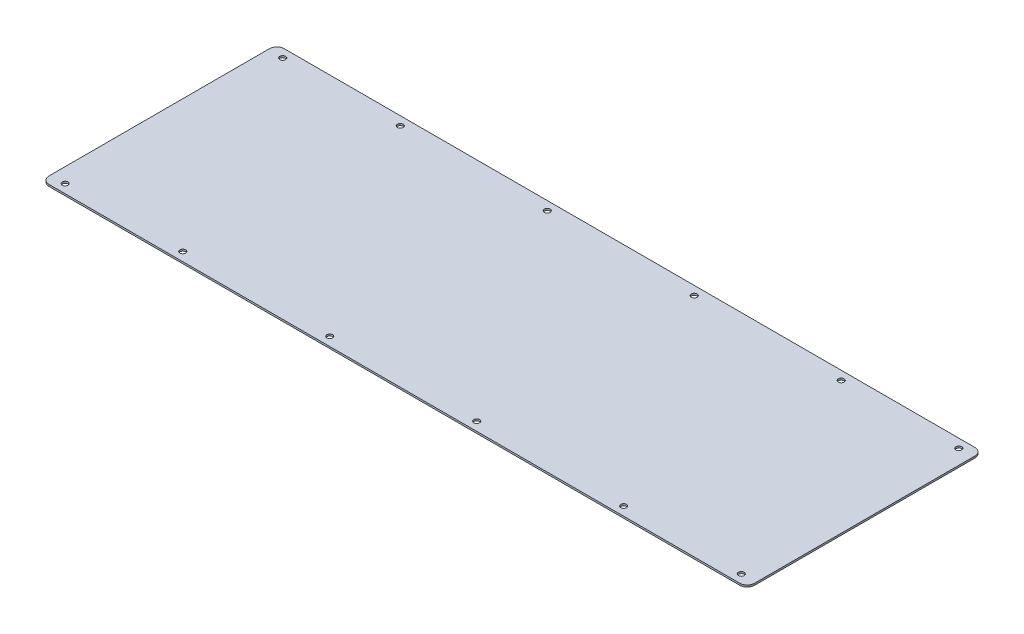
ISO-10303-21;
HEADER;
FILE_DESCRIPTION(('STEP AP214'),'2;1');
FILE_NAME('part.step','',(''),(''),'','','');
FILE_SCHEMA(('AUTOMOTIVE_DESIGN { 1 0 10303 214 1 1 1 1 }'));
ENDSEC;
DATA;
#1=APPLICATION_CONTEXT('core data for automotive mechanical design processes');
#2=APPLICATION_PROTOCOL_DEFINITION('international standard','automotive_design',2000,#1);
#3=PRODUCT_CONTEXT('',#1,'mechanical');
#4=PRODUCT('Part','Part','',(#3));
#5=PRODUCT_RELATED_PRODUCT_CATEGORY('part','',(#4));
#6=PRODUCT_DEFINITION_FORMATION('','',#4);
#7=PRODUCT_DEFINITION_CONTEXT('part definition',#1,'design');
#8=PRODUCT_DEFINITION('design','',#6,#7);
#9=PRODUCT_DEFINITION_SHAPE('','',#8);
#10=(LENGTH_UNIT() NAMED_UNIT(*) SI_UNIT(.MILLI.,.METRE.));
#11=(NAMED_UNIT(*) PLANE_ANGLE_UNIT() SI_UNIT($,.RADIAN.));
#12=(NAMED_UNIT(*) SI_UNIT($,.STERADIAN.) SOLID_ANGLE_UNIT());
#13=UNCERTAINTY_MEASURE_WITH_UNIT(LENGTH_MEASURE(1.E-05),#10,'distance_accuracy_value','');
#14=(GEOMETRIC_REPRESENTATION_CONTEXT(3) GLOBAL_UNCERTAINTY_ASSIGNED_CONTEXT((#13)) GLOBAL_UNIT_ASSIGNED_CONTEXT((#10,
#11,#12)) REPRESENTATION_CONTEXT('',''));
#15=CARTESIAN_POINT('',(0.,0.,0.));
#16=DIRECTION('',(0.,0.,1.));
#17=DIRECTION('',(1.,0.,0.));
#18=AXIS2_PLACEMENT_3D('',#15,#16,#17);
#19=CARTESIAN_POINT('',(0.,1.5875,0.));
#20=DIRECTION('',(1.,0.,0.));
#21=DIRECTION('',(0.,0.,-1.));
#22=AXIS2_PLACEMENT_3D('',#19,#20,#21);
#23=PLANE('',#22);
#24=DIRECTION('',(0.,0.,1.));
#25=VECTOR('',#24,1.);
#26=CARTESIAN_POINT('',(0.,1.5875,0.));
#27=LINE('',#26,#25);
#28=CARTESIAN_POINT('',(0.,1.5875,-196.85));
#29=VERTEX_POINT('',#28);
#30=CARTESIAN_POINT('',(0.,1.5875,-6.35));
#31=VERTEX_POINT('',#30);
#32=EDGE_CURVE('E118',#29,#31,#27,.T.);
#33=ORIENTED_EDGE('',*,*,#32,.F.);
#34=DIRECTION('',(0.,-1.,0.));
#35=VECTOR('',#34,1.);
#36=CARTESIAN_POINT('',(0.,1.5875,-196.85));
#37=LINE('',#36,#35);
#38=CARTESIAN_POINT('',(0.,0.,-196.85));
#39=VERTEX_POINT('',#38);
#40=EDGE_CURVE('E103',#29,#39,#37,.T.);
#41=ORIENTED_EDGE('',*,*,#40,.T.);
#42=DIRECTION('',(0.,0.,1.));
#43=VECTOR('',#42,1.);
#44=CARTESIAN_POINT('',(0.,0.,0.));
#45=LINE('',#44,#43);
#46=CARTESIAN_POINT('',(0.,0.,-6.35));
#47=VERTEX_POINT('',#46);
#48=EDGE_CURVE('E115',#39,#47,#45,.T.);
#49=ORIENTED_EDGE('',*,*,#48,.T.);
#50=DIRECTION('',(0.,-1.,0.));
#51=VECTOR('',#50,1.);
#52=CARTESIAN_POINT('',(0.,1.5875,-6.35));
#53=LINE('',#52,#51);
#54=EDGE_CURVE('E120',#47,#31,#53,.F.);
#55=ORIENTED_EDGE('',*,*,#54,.T.);
#56=EDGE_LOOP('',(#33,#41,#49,#55));
#57=FACE_BOUND('',#56,.T.);
#58=ADVANCED_FACE('F33',(#57),#23,.F.);
#59=CARTESIAN_POINT('',(0.,1.5875,0.));
#60=DIRECTION('',(0.,0.,-1.));
#61=DIRECTION('',(-1.,0.,0.));
#62=AXIS2_PLACEMENT_3D('',#59,#60,#61);
#63=PLANE('',#62);
#64=DIRECTION('',(1.,0.,0.));
#65=VECTOR('',#64,1.);
#66=CARTESIAN_POINT('',(0.,0.,0.));
#67=LINE('',#66,#65);
#68=CARTESIAN_POINT('',(6.35,0.,0.));
#69=VERTEX_POINT('',#68);
#70=CARTESIAN_POINT('',(603.25,0.,0.));
#71=VERTEX_POINT('',#70);
#72=EDGE_CURVE('E124',#69,#71,#67,.T.);
#73=ORIENTED_EDGE('',*,*,#72,.T.);
#74=DIRECTION('',(0.,-1.,0.));
#75=VECTOR('',#74,1.);
#76=CARTESIAN_POINT('',(603.25,1.5875,0.));
#77=LINE('',#76,#75);
#78=CARTESIAN_POINT('',(603.25,1.5875,0.));
#79=VERTEX_POINT('',#78);
#80=EDGE_CURVE('E11',#71,#79,#77,.F.);
#81=ORIENTED_EDGE('',*,*,#80,.T.);
#82=DIRECTION('',(1.,0.,0.));
#83=VECTOR('',#82,1.);
#84=CARTESIAN_POINT('',(0.,1.5875,0.));
#85=LINE('',#84,#83);
#86=CARTESIAN_POINT('',(6.35,1.5875,0.));
#87=VERTEX_POINT('',#86);
#88=EDGE_CURVE('E164',#87,#79,#85,.T.);
#89=ORIENTED_EDGE('',*,*,#88,.F.);
#90=DIRECTION('',(0.,-1.,0.));
#91=VECTOR('',#90,1.);
#92=CARTESIAN_POINT('',(6.35,1.5875,0.));
#93=LINE('',#92,#91);
#94=EDGE_CURVE('E41',#87,#69,#93,.T.);
#95=ORIENTED_EDGE('',*,*,#94,.T.);
#96=EDGE_LOOP('',(#73,#81,#89,#95));
#97=FACE_BOUND('',#96,.T.);
#98=ADVANCED_FACE('F162',(#97),#63,.F.);
#99=CARTESIAN_POINT('',(609.6,1.5875,0.));
#100=DIRECTION('',(-1.,0.,0.));
#101=DIRECTION('',(0.,0.,1.));
#102=AXIS2_PLACEMENT_3D('',#99,#100,#101);
#103=PLANE('',#102);
#104=DIRECTION('',(0.,0.,-1.));
#105=VECTOR('',#104,1.);
#106=CARTESIAN_POINT('',(609.6,0.,0.));
#107=LINE('',#106,#105);
#108=CARTESIAN_POINT('',(609.6,0.,-6.35));
#109=VERTEX_POINT('',#108);
#110=CARTESIAN_POINT('',(609.6,0.,-196.85));
#111=VERTEX_POINT('',#110);
#112=EDGE_CURVE('E128',#109,#111,#107,.T.);
#113=ORIENTED_EDGE('',*,*,#112,.T.);
#114=DIRECTION('',(0.,-1.,0.));
#115=VECTOR('',#114,1.);
#116=CARTESIAN_POINT('',(609.6,1.5875,-196.85));
#117=LINE('',#116,#115);
#118=CARTESIAN_POINT('',(609.6,1.5875,-196.85));
#119=VERTEX_POINT('',#118);
#120=EDGE_CURVE('E48',#111,#119,#117,.F.);
#121=ORIENTED_EDGE('',*,*,#120,.T.);
#122=DIRECTION('',(0.,0.,-1.));
#123=VECTOR('',#122,1.);
#124=CARTESIAN_POINT('',(609.6,1.5875,0.));
#125=LINE('',#124,#123);
#126=CARTESIAN_POINT('',(609.6,1.5875,-6.35));
#127=VERTEX_POINT('',#126);
#128=EDGE_CURVE('E172',#127,#119,#125,.T.);
#129=ORIENTED_EDGE('',*,*,#128,.F.);
#130=DIRECTION('',(0.,-1.,0.));
#131=VECTOR('',#130,1.);
#132=CARTESIAN_POINT('',(609.6,1.5875,-6.35));
#133=LINE('',#132,#131);
#134=EDGE_CURVE('E155',#127,#109,#133,.T.);
#135=ORIENTED_EDGE('',*,*,#134,.T.);
#136=EDGE_LOOP('',(#113,#121,#129,#135));
#137=FACE_BOUND('',#136,.T.);
#138=ADVANCED_FACE('F171',(#137),#103,.F.);
#139=CARTESIAN_POINT('',(0.,1.5875,-203.2));
#140=DIRECTION('',(0.,0.,1.));
#141=DIRECTION('',(1.,0.,0.));
#142=AXIS2_PLACEMENT_3D('',#139,#140,#141);
#143=PLANE('',#142);
#144=DIRECTION('',(-1.,0.,0.));
#145=VECTOR('',#144,1.);
#146=CARTESIAN_POINT('',(0.,0.,-203.2));
#147=LINE('',#146,#145);
#148=CARTESIAN_POINT('',(603.25,0.,-203.2));
#149=VERTEX_POINT('',#148);
#150=CARTESIAN_POINT('',(6.35,0.,-203.2));
#151=VERTEX_POINT('',#150);
#152=EDGE_CURVE('E138',#149,#151,#147,.T.);
#153=ORIENTED_EDGE('',*,*,#152,.T.);
#154=DIRECTION('',(0.,-1.,0.));
#155=VECTOR('',#154,1.);
#156=CARTESIAN_POINT('',(6.35,1.5875,-203.2));
#157=LINE('',#156,#155);
#158=CARTESIAN_POINT('',(6.35,1.5875,-203.2));
#159=VERTEX_POINT('',#158);
#160=EDGE_CURVE('E104',#151,#159,#157,.F.);
#161=ORIENTED_EDGE('',*,*,#160,.T.);
#162=DIRECTION('',(-1.,0.,0.));
#163=VECTOR('',#162,1.);
#164=CARTESIAN_POINT('',(0.,1.5875,-203.2));
#165=LINE('',#164,#163);
#166=CARTESIAN_POINT('',(603.25,1.5875,-203.2));
#167=VERTEX_POINT('',#166);
#168=EDGE_CURVE('E134',#167,#159,#165,.T.);
#169=ORIENTED_EDGE('',*,*,#168,.F.);
#170=DIRECTION('',(0.,-1.,0.));
#171=VECTOR('',#170,1.);
#172=CARTESIAN_POINT('',(603.25,1.5875,-203.2));
#173=LINE('',#172,#171);
#174=EDGE_CURVE('E109',#167,#149,#173,.T.);
#175=ORIENTED_EDGE('',*,*,#174,.T.);
#176=EDGE_LOOP('',(#153,#161,#169,#175));
#177=FACE_BOUND('',#176,.T.);
#178=ADVANCED_FACE('F260',(#177),#143,.F.);
#179=CARTESIAN_POINT('',(0.,1.5875,0.));
#180=DIRECTION('',(0.,-1.,0.));
#181=DIRECTION('',(0.,0.,-1.));
#182=AXIS2_PLACEMENT_3D('',#179,#180,#181);
#183=PLANE('',#182);
#184=CARTESIAN_POINT('',(368.3,1.5875,-7.62));
#185=DIRECTION('',(0.,1.,0.));
#186=DIRECTION('',(0.,0.,1.));
#187=AXIS2_PLACEMENT_3D('',#184,#185,#186);
#188=CIRCLE('',#187,2.48920000000001);
#189=CARTESIAN_POINT('',(368.3,1.5875,-5.13079999999999));
#190=VERTEX_POINT('',#189);
#191=EDGE_CURVE('E212',#190,#190,#188,.T.);
#192=ORIENTED_EDGE('',*,*,#191,.F.);
#193=EDGE_LOOP('',(#192));
#194=FACE_BOUND('',#193,.T.);
#195=CARTESIAN_POINT('',(368.3,1.5875,-195.58));
#196=DIRECTION('',(0.,1.,0.));
#197=DIRECTION('',(0.,0.,-1.));
#198=AXIS2_PLACEMENT_3D('',#195,#196,#197);
#199=CIRCLE('',#198,2.48920000000001);
#200=CARTESIAN_POINT('',(368.3,1.5875,-198.0692));
#201=VERTEX_POINT('',#200);
#202=EDGE_CURVE('E205',#201,#201,#199,.T.);
#203=ORIENTED_EDGE('',*,*,#202,.F.);
#204=EDGE_LOOP('',(#203));
#205=FACE_BOUND('',#204,.T.);
#206=CARTESIAN_POINT('',(241.3,1.5875,-195.58));
#207=DIRECTION('',(0.,1.,0.));
#208=DIRECTION('',(0.,0.,-1.));
#209=AXIS2_PLACEMENT_3D('',#206,#207,#208);
#210=CIRCLE('',#209,2.4892);
#211=CARTESIAN_POINT('',(241.3,1.5875,-198.0692));
#212=VERTEX_POINT('',#211);
#213=EDGE_CURVE('E224',#212,#212,#210,.T.);
#214=ORIENTED_EDGE('',*,*,#213,.F.);
#215=EDGE_LOOP('',(#214));
#216=FACE_BOUND('',#215,.T.);
#217=CARTESIAN_POINT('',(495.3,1.5875,-195.58));
#218=DIRECTION('',(0.,1.,0.));
#219=DIRECTION('',(0.,0.,-1.));
#220=AXIS2_PLACEMENT_3D('',#217,#218,#219);
#221=CIRCLE('',#220,2.48920000000001);
#222=CARTESIAN_POINT('',(495.3,1.5875,-198.0692));
#223=VERTEX_POINT('',#222);
#224=EDGE_CURVE('E217',#223,#223,#221,.T.);
#225=ORIENTED_EDGE('',*,*,#224,.F.);
#226=EDGE_LOOP('',(#225));
#227=FACE_BOUND('',#226,.T.);
#228=CARTESIAN_POINT('',(596.9,1.5875,-7.62));
#229=DIRECTION('',(0.,1.,0.));
#230=DIRECTION('',(0.,0.,1.));
#231=AXIS2_PLACEMENT_3D('',#228,#229,#230);
#232=CIRCLE('',#231,2.48919999999995);
#233=CARTESIAN_POINT('',(596.9,1.5875,-5.13080000000005));
#234=VERTEX_POINT('',#233);
#235=EDGE_CURVE('E188',#234,#234,#232,.T.);
#236=ORIENTED_EDGE('',*,*,#235,.F.);
#237=EDGE_LOOP('',(#236));
#238=FACE_BOUND('',#237,.T.);
#239=CARTESIAN_POINT('',(114.3,1.5875,-7.62));
#240=DIRECTION('',(0.,1.,0.));
#241=DIRECTION('',(0.,0.,1.));
#242=AXIS2_PLACEMENT_3D('',#239,#240,#241);
#243=CIRCLE('',#242,2.4892);
#244=CARTESIAN_POINT('',(114.3,1.5875,-5.1308));
#245=VERTEX_POINT('',#244);
#246=EDGE_CURVE('E181',#245,#245,#243,.T.);
#247=ORIENTED_EDGE('',*,*,#246,.F.);
#248=EDGE_LOOP('',(#247));
#249=FACE_BOUND('',#248,.T.);
#250=CARTESIAN_POINT('',(495.3,1.5875,-7.62));
#251=DIRECTION('',(0.,1.,0.));
#252=DIRECTION('',(0.,0.,1.));
#253=AXIS2_PLACEMENT_3D('',#250,#251,#252);
#254=CIRCLE('',#253,2.48920000000001);
#255=CARTESIAN_POINT('',(495.3,1.5875,-5.13079999999999));
#256=VERTEX_POINT('',#255);
#257=EDGE_CURVE('E200',#256,#256,#254,.T.);
#258=ORIENTED_EDGE('',*,*,#257,.F.);
#259=EDGE_LOOP('',(#258));
#260=FACE_BOUND('',#259,.T.);
#261=CARTESIAN_POINT('',(241.3,1.5875,-7.62));
#262=DIRECTION('',(0.,1.,0.));
#263=DIRECTION('',(0.,0.,1.));
#264=AXIS2_PLACEMENT_3D('',#261,#262,#263);
#265=CIRCLE('',#264,2.4892);
#266=CARTESIAN_POINT('',(241.3,1.5875,-5.1308));
#267=VERTEX_POINT('',#266);
#268=EDGE_CURVE('E193',#267,#267,#265,.T.);
#269=ORIENTED_EDGE('',*,*,#268,.F.);
#270=EDGE_LOOP('',(#269));
#271=FACE_BOUND('',#270,.T.);
#272=CARTESIAN_POINT('',(114.3,1.5875,-195.58));
#273=DIRECTION('',(0.,1.,0.));
#274=DIRECTION('',(0.,0.,-1.));
#275=AXIS2_PLACEMENT_3D('',#272,#273,#274);
#276=CIRCLE('',#275,2.4892);
#277=CARTESIAN_POINT('',(114.3,1.5875,-198.0692));
#278=VERTEX_POINT('',#277);
#279=EDGE_CURVE('E241',#278,#278,#276,.T.);
#280=ORIENTED_EDGE('',*,*,#279,.F.);
#281=EDGE_LOOP('',(#280));
#282=FACE_BOUND('',#281,.T.);
#283=CARTESIAN_POINT('',(596.9,1.5875,-195.58));
#284=DIRECTION('',(0.,1.,0.));
#285=DIRECTION('',(0.,0.,-1.));
#286=AXIS2_PLACEMENT_3D('',#283,#284,#285);
#287=CIRCLE('',#286,2.48919999999995);
#288=CARTESIAN_POINT('',(596.9,1.5875,-198.0692));
#289=VERTEX_POINT('',#288);
#290=EDGE_CURVE('E235',#289,#289,#287,.T.);
#291=ORIENTED_EDGE('',*,*,#290,.F.);
#292=EDGE_LOOP('',(#291));
#293=FACE_BOUND('',#292,.T.);
#294=CARTESIAN_POINT('',(12.7000000000004,1.5875,-195.58));
#295=DIRECTION('',(0.,1.,0.));
#296=DIRECTION('',(0.,0.,-1.));
#297=AXIS2_PLACEMENT_3D('',#294,#295,#296);
#298=CIRCLE('',#297,2.48919999999999);
#299=CARTESIAN_POINT('',(12.7000000000004,1.5875,-198.0692));
#300=VERTEX_POINT('',#299);
#301=EDGE_CURVE('E229',#300,#300,#298,.T.);
#302=ORIENTED_EDGE('',*,*,#301,.F.);
#303=EDGE_LOOP('',(#302));
#304=FACE_BOUND('',#303,.T.);
#305=CARTESIAN_POINT('',(12.7,1.5875,-7.61999999999999));
#306=DIRECTION('',(0.,1.,0.));
#307=DIRECTION('',(0.,0.,1.));
#308=AXIS2_PLACEMENT_3D('',#305,#306,#307);
#309=CIRCLE('',#308,2.4892);
#310=CARTESIAN_POINT('',(12.7,1.5875,-5.13079999999999));
#311=VERTEX_POINT('',#310);
#312=EDGE_CURVE('E131',#311,#311,#309,.T.);
#313=ORIENTED_EDGE('',*,*,#312,.F.);
#314=EDGE_LOOP('',(#313));
#315=FACE_BOUND('',#314,.T.);
#316=ORIENTED_EDGE('',*,*,#168,.T.);
#317=CARTESIAN_POINT('',(6.35,1.5875,-196.85));
#318=DIRECTION('',(0.,-1.,0.));
#319=DIRECTION('',(0.,0.,-1.));
#320=AXIS2_PLACEMENT_3D('',#317,#318,#319);
#321=CIRCLE('',#320,6.35);
#322=EDGE_CURVE('E153',#159,#29,#321,.F.);
#323=ORIENTED_EDGE('',*,*,#322,.T.);
#324=ORIENTED_EDGE('',*,*,#32,.T.);
#325=CARTESIAN_POINT('',(6.35,1.5875,-6.35));
#326=DIRECTION('',(0.,-1.,0.));
#327=DIRECTION('',(0.,0.,-1.));
#328=AXIS2_PLACEMENT_3D('',#325,#326,#327);
#329=CIRCLE('',#328,6.35);
#330=EDGE_CURVE('E148',#31,#87,#329,.F.);
#331=ORIENTED_EDGE('',*,*,#330,.T.);
#332=ORIENTED_EDGE('',*,*,#88,.T.);
#333=CARTESIAN_POINT('',(603.25,1.5875,-6.35));
#334=DIRECTION('',(0.,-1.,0.));
#335=DIRECTION('',(0.,0.,-1.));
#336=AXIS2_PLACEMENT_3D('',#333,#334,#335);
#337=CIRCLE('',#336,6.35);
#338=EDGE_CURVE('E55',#79,#127,#337,.F.);
#339=ORIENTED_EDGE('',*,*,#338,.T.);
#340=ORIENTED_EDGE('',*,*,#128,.T.);
#341=CARTESIAN_POINT('',(603.25,1.5875,-196.85));
#342=DIRECTION('',(0.,-1.,0.));
#343=DIRECTION('',(0.,0.,-1.));
#344=AXIS2_PLACEMENT_3D('',#341,#342,#343);
#345=CIRCLE('',#344,6.35);
#346=EDGE_CURVE('E151',#119,#167,#345,.F.);
#347=ORIENTED_EDGE('',*,*,#346,.T.);
#348=EDGE_LOOP('',(#316,#323,#324,#331,#332,#339,#340,#347));
#349=FACE_BOUND('',#348,.T.);
#350=ADVANCED_FACE('F257',(#194,#205,#216,#227,#238,#249,#260,#271,#282,#293,#304,#315,#349),
#183,.F.);
#351=CARTESIAN_POINT('',(0.,0.,0.));
#352=DIRECTION('',(0.,-1.,0.));
#353=DIRECTION('',(0.,0.,-1.));
#354=AXIS2_PLACEMENT_3D('',#351,#352,#353);
#355=PLANE('',#354);
#356=CARTESIAN_POINT('',(368.3,0.,-7.62));
#357=DIRECTION('',(0.,1.,0.));
#358=DIRECTION('',(0.,0.,1.));
#359=AXIS2_PLACEMENT_3D('',#356,#357,#358);
#360=CIRCLE('',#359,2.48920000000001);
#361=CARTESIAN_POINT('',(368.3,0.,-5.13079999999999));
#362=VERTEX_POINT('',#361);
#363=EDGE_CURVE('E197',#362,#362,#360,.T.);
#364=ORIENTED_EDGE('',*,*,#363,.T.);
#365=EDGE_LOOP('',(#364));
#366=FACE_BOUND('',#365,.T.);
#367=CARTESIAN_POINT('',(368.3,0.,-195.58));
#368=DIRECTION('',(0.,1.,0.));
#369=DIRECTION('',(0.,0.,-1.));
#370=AXIS2_PLACEMENT_3D('',#367,#368,#369);
#371=CIRCLE('',#370,2.48920000000001);
#372=CARTESIAN_POINT('',(368.3,0.,-198.0692));
#373=VERTEX_POINT('',#372);
#374=EDGE_CURVE('E208',#373,#373,#371,.T.);
#375=ORIENTED_EDGE('',*,*,#374,.T.);
#376=EDGE_LOOP('',(#375));
#377=FACE_BOUND('',#376,.T.);
#378=CARTESIAN_POINT('',(241.3,0.,-195.58));
#379=DIRECTION('',(0.,1.,0.));
#380=DIRECTION('',(0.,0.,-1.));
#381=AXIS2_PLACEMENT_3D('',#378,#379,#380);
#382=CIRCLE('',#381,2.4892);
#383=CARTESIAN_POINT('',(241.3,0.,-198.0692));
#384=VERTEX_POINT('',#383);
#385=EDGE_CURVE('E209',#384,#384,#382,.T.);
#386=ORIENTED_EDGE('',*,*,#385,.T.);
#387=EDGE_LOOP('',(#386));
#388=FACE_BOUND('',#387,.T.);
#389=CARTESIAN_POINT('',(495.3,0.,-195.58));
#390=DIRECTION('',(0.,1.,0.));
#391=DIRECTION('',(0.,0.,-1.));
#392=AXIS2_PLACEMENT_3D('',#389,#390,#391);
#393=CIRCLE('',#392,2.48920000000001);
#394=CARTESIAN_POINT('',(495.3,0.,-198.0692));
#395=VERTEX_POINT('',#394);
#396=EDGE_CURVE('E220',#395,#395,#393,.T.);
#397=ORIENTED_EDGE('',*,*,#396,.T.);
#398=EDGE_LOOP('',(#397));
#399=FACE_BOUND('',#398,.T.);
#400=CARTESIAN_POINT('',(596.9,0.,-7.62));
#401=DIRECTION('',(0.,1.,0.));
#402=DIRECTION('',(0.,0.,1.));
#403=AXIS2_PLACEMENT_3D('',#400,#401,#402);
#404=CIRCLE('',#403,2.48919999999995);
#405=CARTESIAN_POINT('',(596.9,0.,-5.13080000000005));
#406=VERTEX_POINT('',#405);
#407=EDGE_CURVE('E179',#406,#406,#404,.T.);
#408=ORIENTED_EDGE('',*,*,#407,.T.);
#409=EDGE_LOOP('',(#408));
#410=FACE_BOUND('',#409,.T.);
#411=CARTESIAN_POINT('',(114.3,0.,-7.62));
#412=DIRECTION('',(0.,1.,0.));
#413=DIRECTION('',(0.,0.,1.));
#414=AXIS2_PLACEMENT_3D('',#411,#412,#413);
#415=CIRCLE('',#414,2.4892);
#416=CARTESIAN_POINT('',(114.3,0.,-5.1308));
#417=VERTEX_POINT('',#416);
#418=EDGE_CURVE('E184',#417,#417,#415,.T.);
#419=ORIENTED_EDGE('',*,*,#418,.T.);
#420=EDGE_LOOP('',(#419));
#421=FACE_BOUND('',#420,.T.);
#422=CARTESIAN_POINT('',(495.3,0.,-7.62));
#423=DIRECTION('',(0.,1.,0.));
#424=DIRECTION('',(0.,0.,1.));
#425=AXIS2_PLACEMENT_3D('',#422,#423,#424);
#426=CIRCLE('',#425,2.48920000000001);
#427=CARTESIAN_POINT('',(495.3,0.,-5.13079999999999));
#428=VERTEX_POINT('',#427);
#429=EDGE_CURVE('E185',#428,#428,#426,.T.);
#430=ORIENTED_EDGE('',*,*,#429,.T.);
#431=EDGE_LOOP('',(#430));
#432=FACE_BOUND('',#431,.T.);
#433=CARTESIAN_POINT('',(241.3,0.,-7.62));
#434=DIRECTION('',(0.,1.,0.));
#435=DIRECTION('',(0.,0.,1.));
#436=AXIS2_PLACEMENT_3D('',#433,#434,#435);
#437=CIRCLE('',#436,2.4892);
#438=CARTESIAN_POINT('',(241.3,0.,-5.1308));
#439=VERTEX_POINT('',#438);
#440=EDGE_CURVE('E196',#439,#439,#437,.T.);
#441=ORIENTED_EDGE('',*,*,#440,.T.);
#442=EDGE_LOOP('',(#441));
#443=FACE_BOUND('',#442,.T.);
#444=CARTESIAN_POINT('',(114.3,0.,-195.58));
#445=DIRECTION('',(0.,1.,0.));
#446=DIRECTION('',(0.,0.,-1.));
#447=AXIS2_PLACEMENT_3D('',#444,#445,#446);
#448=CIRCLE('',#447,2.4892);
#449=CARTESIAN_POINT('',(114.3,0.,-198.0692));
#450=VERTEX_POINT('',#449);
#451=EDGE_CURVE('E221',#450,#450,#448,.T.);
#452=ORIENTED_EDGE('',*,*,#451,.T.);
#453=EDGE_LOOP('',(#452));
#454=FACE_BOUND('',#453,.T.);
#455=CARTESIAN_POINT('',(596.9,0.,-195.58));
#456=DIRECTION('',(0.,1.,0.));
#457=DIRECTION('',(0.,0.,-1.));
#458=AXIS2_PLACEMENT_3D('',#455,#456,#457);
#459=CIRCLE('',#458,2.48919999999995);
#460=CARTESIAN_POINT('',(596.9,0.,-198.0692));
#461=VERTEX_POINT('',#460);
#462=EDGE_CURVE('E238',#461,#461,#459,.T.);
#463=ORIENTED_EDGE('',*,*,#462,.T.);
#464=EDGE_LOOP('',(#463));
#465=FACE_BOUND('',#464,.T.);
#466=CARTESIAN_POINT('',(12.7000000000004,0.,-195.58));
#467=DIRECTION('',(0.,1.,0.));
#468=DIRECTION('',(0.,0.,-1.));
#469=AXIS2_PLACEMENT_3D('',#466,#467,#468);
#470=CIRCLE('',#469,2.48919999999999);
#471=CARTESIAN_POINT('',(12.7000000000004,0.,-198.0692));
#472=VERTEX_POINT('',#471);
#473=EDGE_CURVE('E232',#472,#472,#470,.T.);
#474=ORIENTED_EDGE('',*,*,#473,.T.);
#475=EDGE_LOOP('',(#474));
#476=FACE_BOUND('',#475,.T.);
#477=CARTESIAN_POINT('',(12.7,0.,-7.61999999999999));
#478=DIRECTION('',(0.,1.,0.));
#479=DIRECTION('',(0.,0.,1.));
#480=AXIS2_PLACEMENT_3D('',#477,#478,#479);
#481=CIRCLE('',#480,2.4892);
#482=CARTESIAN_POINT('',(12.7,0.,-5.13079999999999));
#483=VERTEX_POINT('',#482);
#484=EDGE_CURVE('E125',#483,#483,#481,.T.);
#485=ORIENTED_EDGE('',*,*,#484,.T.);
#486=EDGE_LOOP('',(#485));
#487=FACE_BOUND('',#486,.T.);
#488=ORIENTED_EDGE('',*,*,#48,.F.);
#489=CARTESIAN_POINT('',(6.35,0.,-196.85));
#490=DIRECTION('',(0.,-1.,0.));
#491=DIRECTION('',(0.,0.,-1.));
#492=AXIS2_PLACEMENT_3D('',#489,#490,#491);
#493=CIRCLE('',#492,6.35);
#494=EDGE_CURVE('E99',#39,#151,#493,.T.);
#495=ORIENTED_EDGE('',*,*,#494,.T.);
#496=ORIENTED_EDGE('',*,*,#152,.F.);
#497=CARTESIAN_POINT('',(603.25,0.,-196.85));
#498=DIRECTION('',(0.,-1.,0.));
#499=DIRECTION('',(0.,0.,-1.));
#500=AXIS2_PLACEMENT_3D('',#497,#498,#499);
#501=CIRCLE('',#500,6.35);
#502=EDGE_CURVE('E110',#149,#111,#501,.T.);
#503=ORIENTED_EDGE('',*,*,#502,.T.);
#504=ORIENTED_EDGE('',*,*,#112,.F.);
#505=CARTESIAN_POINT('',(603.25,0.,-6.35));
#506=DIRECTION('',(0.,-1.,0.));
#507=DIRECTION('',(0.,0.,-1.));
#508=AXIS2_PLACEMENT_3D('',#505,#506,#507);
#509=CIRCLE('',#508,6.35);
#510=EDGE_CURVE('E142',#109,#71,#509,.T.);
#511=ORIENTED_EDGE('',*,*,#510,.T.);
#512=ORIENTED_EDGE('',*,*,#72,.F.);
#513=CARTESIAN_POINT('',(6.35,0.,-6.35));
#514=DIRECTION('',(0.,-1.,0.));
#515=DIRECTION('',(0.,0.,-1.));
#516=AXIS2_PLACEMENT_3D('',#513,#514,#515);
#517=CIRCLE('',#516,6.35);
#518=EDGE_CURVE('E119',#69,#47,#517,.T.);
#519=ORIENTED_EDGE('',*,*,#518,.T.);
#520=EDGE_LOOP('',(#488,#495,#496,#503,#504,#511,#512,#519));
#521=FACE_BOUND('',#520,.T.);
#522=ADVANCED_FACE('F122',(#366,#377,#388,#399,#410,#421,#432,#443,#454,#465,#476,#487,#521),
#355,.T.);
#523=CARTESIAN_POINT('',(6.35,1.5875,-196.85));
#524=DIRECTION('',(0.,-1.,0.));
#525=DIRECTION('',(0.,0.,-1.));
#526=AXIS2_PLACEMENT_3D('',#523,#524,#525);
#527=CYLINDRICAL_SURFACE('',#526,6.35);
#528=ORIENTED_EDGE('',*,*,#322,.F.);
#529=ORIENTED_EDGE('',*,*,#160,.F.);
#530=ORIENTED_EDGE('',*,*,#494,.F.);
#531=ORIENTED_EDGE('',*,*,#40,.F.);
#532=EDGE_LOOP('',(#528,#529,#530,#531));
#533=FACE_BOUND('',#532,.T.);
#534=ADVANCED_FACE('F102',(#533),#527,.T.);
#535=CARTESIAN_POINT('',(603.25,1.5875,-196.85));
#536=DIRECTION('',(0.,-1.,0.));
#537=DIRECTION('',(0.,0.,-1.));
#538=AXIS2_PLACEMENT_3D('',#535,#536,#537);
#539=CYLINDRICAL_SURFACE('',#538,6.35);
#540=ORIENTED_EDGE('',*,*,#346,.F.);
#541=ORIENTED_EDGE('',*,*,#120,.F.);
#542=ORIENTED_EDGE('',*,*,#502,.F.);
#543=ORIENTED_EDGE('',*,*,#174,.F.);
#544=EDGE_LOOP('',(#540,#541,#542,#543));
#545=FACE_BOUND('',#544,.T.);
#546=ADVANCED_FACE('F272',(#545),#539,.T.);
#547=CARTESIAN_POINT('',(603.25,1.5875,-6.35));
#548=DIRECTION('',(0.,-1.,0.));
#549=DIRECTION('',(0.,0.,-1.));
#550=AXIS2_PLACEMENT_3D('',#547,#548,#549);
#551=CYLINDRICAL_SURFACE('',#550,6.35);
#552=ORIENTED_EDGE('',*,*,#338,.F.);
#553=ORIENTED_EDGE('',*,*,#80,.F.);
#554=ORIENTED_EDGE('',*,*,#510,.F.);
#555=ORIENTED_EDGE('',*,*,#134,.F.);
#556=EDGE_LOOP('',(#552,#553,#554,#555));
#557=FACE_BOUND('',#556,.T.);
#558=ADVANCED_FACE('F170',(#557),#551,.T.);
#559=CARTESIAN_POINT('',(6.35,1.5875,-6.35));
#560=DIRECTION('',(0.,-1.,0.));
#561=DIRECTION('',(0.,0.,-1.));
#562=AXIS2_PLACEMENT_3D('',#559,#560,#561);
#563=CYLINDRICAL_SURFACE('',#562,6.35);
#564=ORIENTED_EDGE('',*,*,#330,.F.);
#565=ORIENTED_EDGE('',*,*,#54,.F.);
#566=ORIENTED_EDGE('',*,*,#518,.F.);
#567=ORIENTED_EDGE('',*,*,#94,.F.);
#568=EDGE_LOOP('',(#564,#565,#566,#567));
#569=FACE_BOUND('',#568,.T.);
#570=ADVANCED_FACE('F35',(#569),#563,.T.);
#571=CARTESIAN_POINT('',(12.7,0.,-7.61999999999999));
#572=DIRECTION('',(0.,1.,0.));
#573=DIRECTION('',(0.,0.,1.));
#574=AXIS2_PLACEMENT_3D('',#571,#572,#573);
#575=CYLINDRICAL_SURFACE('',#574,2.4892);
#576=ORIENTED_EDGE('',*,*,#484,.F.);
#577=EDGE_LOOP('',(#576));
#578=FACE_BOUND('',#577,.T.);
#579=ORIENTED_EDGE('',*,*,#312,.T.);
#580=EDGE_LOOP('',(#579));
#581=FACE_BOUND('',#580,.T.);
#582=ADVANCED_FACE('F294',(#578,#581),#575,.F.);
#583=CARTESIAN_POINT('',(12.7000000000004,0.,-195.58));
#584=DIRECTION('',(0.,1.,0.));
#585=DIRECTION('',(0.,0.,1.));
#586=AXIS2_PLACEMENT_3D('',#583,#584,#585);
#587=CYLINDRICAL_SURFACE('',#586,2.48919999999999);
#588=ORIENTED_EDGE('',*,*,#473,.F.);
#589=EDGE_LOOP('',(#588));
#590=FACE_BOUND('',#589,.T.);
#591=ORIENTED_EDGE('',*,*,#301,.T.);
#592=EDGE_LOOP('',(#591));
#593=FACE_BOUND('',#592,.T.);
#594=ADVANCED_FACE('F297',(#590,#593),#587,.F.);
#595=CARTESIAN_POINT('',(596.9,0.,-195.58));
#596=DIRECTION('',(0.,1.,0.));
#597=DIRECTION('',(0.,0.,1.));
#598=AXIS2_PLACEMENT_3D('',#595,#596,#597);
#599=CYLINDRICAL_SURFACE('',#598,2.48919999999995);
#600=ORIENTED_EDGE('',*,*,#462,.F.);
#601=EDGE_LOOP('',(#600));
#602=FACE_BOUND('',#601,.T.);
#603=ORIENTED_EDGE('',*,*,#290,.T.);
#604=EDGE_LOOP('',(#603));
#605=FACE_BOUND('',#604,.T.);
#606=ADVANCED_FACE('F253',(#602,#605),#599,.F.);
#607=CARTESIAN_POINT('',(114.3,0.,-195.58));
#608=DIRECTION('',(0.,1.,0.));
#609=DIRECTION('',(0.,0.,1.));
#610=AXIS2_PLACEMENT_3D('',#607,#608,#609);
#611=CYLINDRICAL_SURFACE('',#610,2.4892);
#612=ORIENTED_EDGE('',*,*,#451,.F.);
#613=EDGE_LOOP('',(#612));
#614=FACE_BOUND('',#613,.T.);
#615=ORIENTED_EDGE('',*,*,#279,.T.);
#616=EDGE_LOOP('',(#615));
#617=FACE_BOUND('',#616,.T.);
#618=ADVANCED_FACE('F249',(#614,#617),#611,.F.);
#619=CARTESIAN_POINT('',(241.3,0.,-7.62));
#620=DIRECTION('',(0.,1.,0.));
#621=DIRECTION('',(0.,0.,1.));
#622=AXIS2_PLACEMENT_3D('',#619,#620,#621);
#623=CYLINDRICAL_SURFACE('',#622,2.4892);
#624=ORIENTED_EDGE('',*,*,#440,.F.);
#625=EDGE_LOOP('',(#624));
#626=FACE_BOUND('',#625,.T.);
#627=ORIENTED_EDGE('',*,*,#268,.T.);
#628=EDGE_LOOP('',(#627));
#629=FACE_BOUND('',#628,.T.);
#630=ADVANCED_FACE('F252',(#626,#629),#623,.F.);
#631=CARTESIAN_POINT('',(495.3,0.,-7.62));
#632=DIRECTION('',(0.,1.,0.));
#633=DIRECTION('',(0.,0.,1.));
#634=AXIS2_PLACEMENT_3D('',#631,#632,#633);
#635=CYLINDRICAL_SURFACE('',#634,2.48920000000001);
#636=ORIENTED_EDGE('',*,*,#429,.F.);
#637=EDGE_LOOP('',(#636));
#638=FACE_BOUND('',#637,.T.);
#639=ORIENTED_EDGE('',*,*,#257,.T.);
#640=EDGE_LOOP('',(#639));
#641=FACE_BOUND('',#640,.T.);
#642=ADVANCED_FACE('F303',(#638,#641),#635,.F.);
#643=CARTESIAN_POINT('',(114.3,0.,-7.62));
#644=DIRECTION('',(0.,1.,0.));
#645=DIRECTION('',(0.,0.,1.));
#646=AXIS2_PLACEMENT_3D('',#643,#644,#645);
#647=CYLINDRICAL_SURFACE('',#646,2.4892);
#648=ORIENTED_EDGE('',*,*,#418,.F.);
#649=EDGE_LOOP('',(#648));
#650=FACE_BOUND('',#649,.T.);
#651=ORIENTED_EDGE('',*,*,#246,.T.);
#652=EDGE_LOOP('',(#651));
#653=FACE_BOUND('',#652,.T.);
#654=ADVANCED_FACE('F299',(#650,#653),#647,.F.);
#655=CARTESIAN_POINT('',(596.9,0.,-7.62));
#656=DIRECTION('',(0.,1.,0.));
#657=DIRECTION('',(0.,0.,1.));
#658=AXIS2_PLACEMENT_3D('',#655,#656,#657);
#659=CYLINDRICAL_SURFACE('',#658,2.48919999999995);
#660=ORIENTED_EDGE('',*,*,#407,.F.);
#661=EDGE_LOOP('',(#660));
#662=FACE_BOUND('',#661,.T.);
#663=ORIENTED_EDGE('',*,*,#235,.T.);
#664=EDGE_LOOP('',(#663));
#665=FACE_BOUND('',#664,.T.);
#666=ADVANCED_FACE('F302',(#662,#665),#659,.F.);
#667=CARTESIAN_POINT('',(495.3,0.,-195.58));
#668=DIRECTION('',(0.,1.,0.));
#669=DIRECTION('',(0.,0.,1.));
#670=AXIS2_PLACEMENT_3D('',#667,#668,#669);
#671=CYLINDRICAL_SURFACE('',#670,2.48920000000001);
#672=ORIENTED_EDGE('',*,*,#396,.F.);
#673=EDGE_LOOP('',(#672));
#674=FACE_BOUND('',#673,.T.);
#675=ORIENTED_EDGE('',*,*,#224,.T.);
#676=EDGE_LOOP('',(#675));
#677=FACE_BOUND('',#676,.T.);
#678=ADVANCED_FACE('F307',(#674,#677),#671,.F.);
#679=CARTESIAN_POINT('',(241.3,0.,-195.58));
#680=DIRECTION('',(0.,1.,0.));
#681=DIRECTION('',(0.,0.,1.));
#682=AXIS2_PLACEMENT_3D('',#679,#680,#681);
#683=CYLINDRICAL_SURFACE('',#682,2.4892);
#684=ORIENTED_EDGE('',*,*,#385,.F.);
#685=EDGE_LOOP('',(#684));
#686=FACE_BOUND('',#685,.T.);
#687=ORIENTED_EDGE('',*,*,#213,.T.);
#688=EDGE_LOOP('',(#687));
#689=FACE_BOUND('',#688,.T.);
#690=ADVANCED_FACE('F319',(#686,#689),#683,.F.);
#691=CARTESIAN_POINT('',(368.3,0.,-195.58));
#692=DIRECTION('',(0.,1.,0.));
#693=DIRECTION('',(0.,0.,1.));
#694=AXIS2_PLACEMENT_3D('',#691,#692,#693);
#695=CYLINDRICAL_SURFACE('',#694,2.48920000000001);
#696=ORIENTED_EDGE('',*,*,#374,.F.);
#697=EDGE_LOOP('',(#696));
#698=FACE_BOUND('',#697,.T.);
#699=ORIENTED_EDGE('',*,*,#202,.T.);
#700=EDGE_LOOP('',(#699));
#701=FACE_BOUND('',#700,.T.);
#702=ADVANCED_FACE('F315',(#698,#701),#695,.F.);
#703=CARTESIAN_POINT('',(368.3,0.,-7.62));
#704=DIRECTION('',(0.,1.,0.));
#705=DIRECTION('',(0.,0.,1.));
#706=AXIS2_PLACEMENT_3D('',#703,#704,#705);
#707=CYLINDRICAL_SURFACE('',#706,2.48920000000001);
#708=ORIENTED_EDGE('',*,*,#363,.F.);
#709=EDGE_LOOP('',(#708));
#710=FACE_BOUND('',#709,.T.);
#711=ORIENTED_EDGE('',*,*,#191,.T.);
#712=EDGE_LOOP('',(#711));
#713=FACE_BOUND('',#712,.T.);
#714=ADVANCED_FACE('F318',(#710,#713),#707,.F.);
#715=CLOSED_SHELL('',(#58,#98,#138,#178,#350,#522,#534,#546,#558,#570,#582,#594,#606,#618,#630,
#642,#654,#666,#678,#690,#702,#714));
#716=MANIFOLD_SOLID_BREP('B2',#715);
#717=ADVANCED_BREP_SHAPE_REPRESENTATION('',(#18,#716),#14);
#718=SHAPE_DEFINITION_REPRESENTATION(#9,#717);
ENDSEC;
END-ISO-10303-21;
